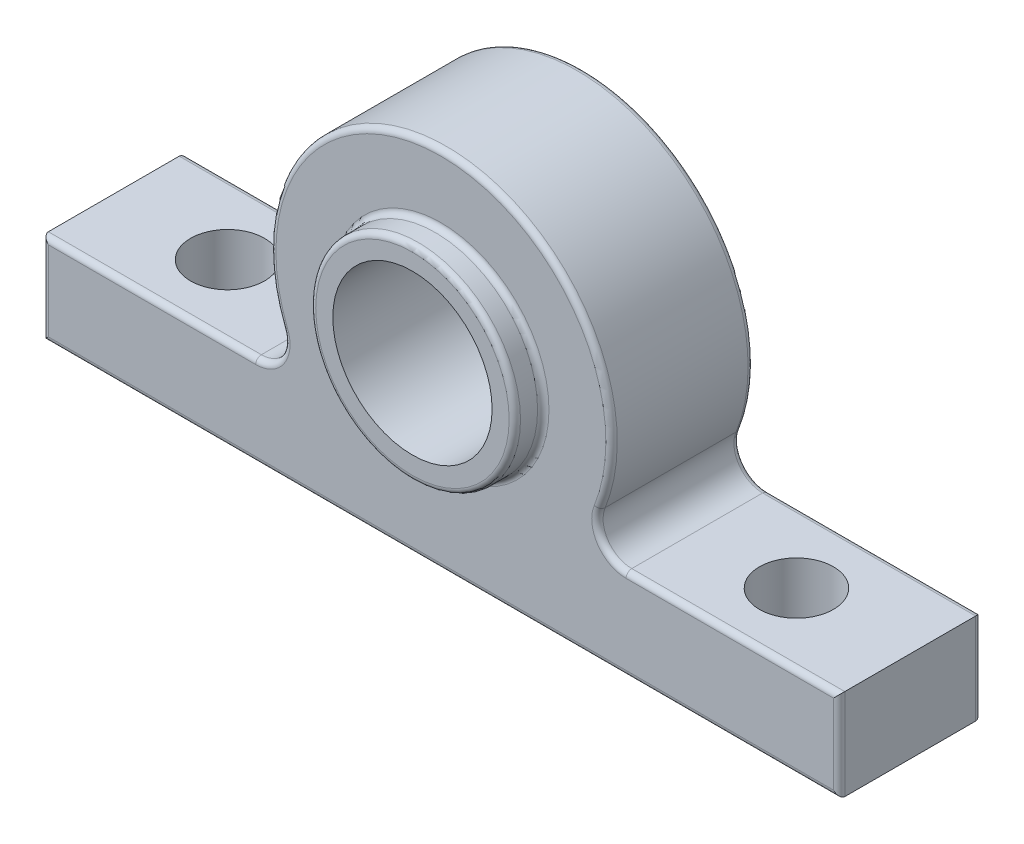
ISO-10303-21;
HEADER;
FILE_DESCRIPTION(('STEP AP214'),'2;1');
FILE_NAME('part.step','',(''),(''),'','','');
FILE_SCHEMA(('AUTOMOTIVE_DESIGN { 1 0 10303 214 1 1 1 1 }'));
ENDSEC;
DATA;
#1=APPLICATION_CONTEXT('core data for automotive mechanical design processes');
#2=APPLICATION_PROTOCOL_DEFINITION('international standard','automotive_design',2000,#1);
#3=PRODUCT_CONTEXT('',#1,'mechanical');
#4=PRODUCT('Part','Part','',(#3));
#5=PRODUCT_RELATED_PRODUCT_CATEGORY('part','',(#4));
#6=PRODUCT_DEFINITION_FORMATION('','',#4);
#7=PRODUCT_DEFINITION_CONTEXT('part definition',#1,'design');
#8=PRODUCT_DEFINITION('design','',#6,#7);
#9=PRODUCT_DEFINITION_SHAPE('','',#8);
#10=(LENGTH_UNIT() NAMED_UNIT(*) SI_UNIT(.MILLI.,.METRE.));
#11=(NAMED_UNIT(*) PLANE_ANGLE_UNIT() SI_UNIT($,.RADIAN.));
#12=(NAMED_UNIT(*) SI_UNIT($,.STERADIAN.) SOLID_ANGLE_UNIT());
#13=UNCERTAINTY_MEASURE_WITH_UNIT(LENGTH_MEASURE(1.E-05),#10,'distance_accuracy_value','');
#14=(GEOMETRIC_REPRESENTATION_CONTEXT(3) GLOBAL_UNCERTAINTY_ASSIGNED_CONTEXT((#13)) GLOBAL_UNIT_ASSIGNED_CONTEXT((#10,
#11,#12)) REPRESENTATION_CONTEXT('',''));
#15=CARTESIAN_POINT('',(0.,0.,0.));
#16=DIRECTION('',(0.,0.,1.));
#17=DIRECTION('',(1.,0.,0.));
#18=AXIS2_PLACEMENT_3D('',#15,#16,#17);
#19=CARTESIAN_POINT('',(0.,34.000000000006,25.));
#20=DIRECTION('',(0.,0.,-1.));
#21=DIRECTION('',(-1.,0.,0.));
#22=AXIS2_PLACEMENT_3D('',#19,#20,#21);
#23=CYLINDRICAL_SURFACE('',#22,14.00000000001);
#24=CARTESIAN_POINT('',(-1.2490009027033E-13,34.0000000000059,30.));
#25=DIRECTION('',(0.,0.,1.));
#26=DIRECTION('',(1.,0.,0.));
#27=AXIS2_PLACEMENT_3D('',#24,#25,#26);
#28=CIRCLE('',#27,14.0000000000099);
#29=CARTESIAN_POINT('',(14.0000000000097,34.0000000000059,30.));
#30=VERTEX_POINT('',#29);
#31=EDGE_CURVE('E477',#30,#30,#28,.T.);
#32=ORIENTED_EDGE('',*,*,#31,.T.);
#33=EDGE_LOOP('',(#32));
#34=FACE_BOUND('',#33,.T.);
#35=CARTESIAN_POINT('',(0.,34.000000000006,-5.));
#36=DIRECTION('',(0.,0.,-1.));
#37=DIRECTION('',(-1.,0.,0.));
#38=AXIS2_PLACEMENT_3D('',#35,#36,#37);
#39=CIRCLE('',#38,14.00000000001);
#40=CARTESIAN_POINT('',(-14.00000000001,34.000000000006,-5.));
#41=VERTEX_POINT('',#40);
#42=EDGE_CURVE('E479',#41,#41,#39,.T.);
#43=ORIENTED_EDGE('',*,*,#42,.T.);
#44=EDGE_LOOP('',(#43));
#45=FACE_BOUND('',#44,.T.);
#46=ADVANCED_FACE('F38',(#34,#45),#23,.F.);
#47=CARTESIAN_POINT('',(-32.5537951325998,21.0393178645808,25.));
#48=DIRECTION('',(0.,0.,-1.));
#49=DIRECTION('',(-1.,0.,0.));
#50=AXIS2_PLACEMENT_3D('',#47,#48,#49);
#51=CYLINDRICAL_SURFACE('',#50,5.03931786457549);
#52=DIRECTION('',(0.,0.,-1.));
#53=VECTOR('',#52,1.);
#54=CARTESIAN_POINT('',(-27.8926749949378,22.9546986628847,25.));
#55=LINE('',#54,#53);
#56=CARTESIAN_POINT('',(-27.8926749949378,22.9546986628847,24.));
#57=VERTEX_POINT('',#56);
#58=CARTESIAN_POINT('',(-27.8926749949378,22.9546986628847,1.));
#59=VERTEX_POINT('',#58);
#60=EDGE_CURVE('E478',#57,#59,#55,.T.);
#61=ORIENTED_EDGE('',*,*,#60,.T.);
#62=CARTESIAN_POINT('',(-32.5537951325998,21.0393178645808,1.));
#63=DIRECTION('',(0.,0.,1.));
#64=DIRECTION('',(1.,0.,0.));
#65=AXIS2_PLACEMENT_3D('',#62,#63,#64);
#66=CIRCLE('',#65,5.03931786457549);
#67=CARTESIAN_POINT('',(-32.5537951325998,16.0000000000053,1.));
#68=VERTEX_POINT('',#67);
#69=EDGE_CURVE('E47',#59,#68,#66,.F.);
#70=ORIENTED_EDGE('',*,*,#69,.T.);
#71=DIRECTION('',(0.,0.,-1.));
#72=VECTOR('',#71,1.);
#73=CARTESIAN_POINT('',(-32.5537951325998,16.0000000000053,25.));
#74=LINE('',#73,#72);
#75=CARTESIAN_POINT('',(-32.5537951325998,16.0000000000053,24.));
#76=VERTEX_POINT('',#75);
#77=EDGE_CURVE('E460',#76,#68,#74,.T.);
#78=ORIENTED_EDGE('',*,*,#77,.F.);
#79=CARTESIAN_POINT('',(-32.5537951325998,21.0393178645808,24.));
#80=DIRECTION('',(0.,0.,1.));
#81=DIRECTION('',(1.,0.,0.));
#82=AXIS2_PLACEMENT_3D('',#79,#80,#81);
#83=CIRCLE('',#82,5.03931786457549);
#84=EDGE_CURVE('E201',#76,#57,#83,.T.);
#85=ORIENTED_EDGE('',*,*,#84,.T.);
#86=EDGE_LOOP('',(#61,#70,#78,#85));
#87=FACE_BOUND('',#86,.T.);
#88=ADVANCED_FACE('F304',(#87),#51,.F.);
#89=CARTESIAN_POINT('',(0.,16.0000000000053,25.));
#90=DIRECTION('',(0.,1.,0.));
#91=DIRECTION('',(0.,0.,1.));
#92=AXIS2_PLACEMENT_3D('',#89,#90,#91);
#93=PLANE('',#92);
#94=CARTESIAN_POINT('',(-49.9999999999932,16.0000000000053,12.5));
#95=DIRECTION('',(0.,1.,0.));
#96=DIRECTION('',(0.,0.,1.));
#97=AXIS2_PLACEMENT_3D('',#94,#95,#96);
#98=CIRCLE('',#97,6.5);
#99=CARTESIAN_POINT('',(-49.9999999999932,16.0000000000053,19.));
#100=VERTEX_POINT('',#99);
#101=EDGE_CURVE('E408',#100,#100,#98,.T.);
#102=ORIENTED_EDGE('',*,*,#101,.F.);
#103=EDGE_LOOP('',(#102));
#104=FACE_BOUND('',#103,.T.);
#105=ORIENTED_EDGE('',*,*,#77,.T.);
#106=DIRECTION('',(1.,0.,0.));
#107=VECTOR('',#106,1.);
#108=CARTESIAN_POINT('',(-69.9999999999932,16.0000000000053,1.));
#109=LINE('',#108,#107);
#110=CARTESIAN_POINT('',(-69.9999999999932,16.0000000000053,1.));
#111=VERTEX_POINT('',#110);
#112=EDGE_CURVE('E428',#68,#111,#109,.F.);
#113=ORIENTED_EDGE('',*,*,#112,.T.);
#114=DIRECTION('',(0.,0.,-1.));
#115=VECTOR('',#114,1.);
#116=CARTESIAN_POINT('',(-69.9999999999932,16.0000000000053,25.));
#117=LINE('',#116,#115);
#118=CARTESIAN_POINT('',(-69.9999999999932,16.0000000000053,24.));
#119=VERTEX_POINT('',#118);
#120=EDGE_CURVE('E457',#119,#111,#117,.T.);
#121=ORIENTED_EDGE('',*,*,#120,.F.);
#122=DIRECTION('',(1.,0.,0.));
#123=VECTOR('',#122,1.);
#124=CARTESIAN_POINT('',(0.,16.0000000000053,24.));
#125=LINE('',#124,#123);
#126=EDGE_CURVE('E199',#119,#76,#125,.T.);
#127=ORIENTED_EDGE('',*,*,#126,.T.);
#128=EDGE_LOOP('',(#105,#113,#121,#127));
#129=FACE_BOUND('',#128,.T.);
#130=ADVANCED_FACE('F311',(#104,#129),#93,.T.);
#131=CARTESIAN_POINT('',(-69.9999999999932,-102.119017268005,25.));
#132=DIRECTION('',(1.,0.,0.));
#133=DIRECTION('',(0.,0.,-1.));
#134=AXIS2_PLACEMENT_3D('',#131,#132,#133);
#135=PLANE('',#134);
#136=ORIENTED_EDGE('',*,*,#120,.T.);
#137=DIRECTION('',(0.,-1.,0.));
#138=VECTOR('',#137,1.);
#139=CARTESIAN_POINT('',(-69.9999999999932,-102.119017268005,1.));
#140=LINE('',#139,#138);
#141=CARTESIAN_POINT('',(-69.9999999999932,0.,1.));
#142=VERTEX_POINT('',#141);
#143=EDGE_CURVE('E431',#111,#142,#140,.T.);
#144=ORIENTED_EDGE('',*,*,#143,.T.);
#145=DIRECTION('',(0.,0.,-1.));
#146=VECTOR('',#145,1.);
#147=CARTESIAN_POINT('',(-69.9999999999932,0.,25.));
#148=LINE('',#147,#146);
#149=CARTESIAN_POINT('',(-69.9999999999932,0.,24.));
#150=VERTEX_POINT('',#149);
#151=EDGE_CURVE('E462',#150,#142,#148,.T.);
#152=ORIENTED_EDGE('',*,*,#151,.F.);
#153=DIRECTION('',(0.,-1.,0.));
#154=VECTOR('',#153,1.);
#155=CARTESIAN_POINT('',(-69.9999999999932,16.0000000000053,24.));
#156=LINE('',#155,#154);
#157=EDGE_CURVE('E197',#150,#119,#156,.F.);
#158=ORIENTED_EDGE('',*,*,#157,.T.);
#159=EDGE_LOOP('',(#136,#144,#152,#158));
#160=FACE_BOUND('',#159,.T.);
#161=ADVANCED_FACE('F337',(#160),#135,.F.);
#162=CARTESIAN_POINT('',(0.,0.,25.));
#163=DIRECTION('',(0.,1.,0.));
#164=DIRECTION('',(0.,0.,1.));
#165=AXIS2_PLACEMENT_3D('',#162,#163,#164);
#166=PLANE('',#165);
#167=CARTESIAN_POINT('',(-49.9999999999932,5.34294830600857E-12,12.5));
#168=DIRECTION('',(0.,1.,0.));
#169=DIRECTION('',(0.,0.,1.));
#170=AXIS2_PLACEMENT_3D('',#167,#168,#169);
#171=CIRCLE('',#170,6.5);
#172=CARTESIAN_POINT('',(-49.9999999999932,5.34294830600857E-12,19.));
#173=VERTEX_POINT('',#172);
#174=EDGE_CURVE('E784',#173,#173,#171,.T.);
#175=ORIENTED_EDGE('',*,*,#174,.T.);
#176=EDGE_LOOP('',(#175));
#177=FACE_BOUND('',#176,.T.);
#178=CARTESIAN_POINT('',(49.9999999999932,5.34294830600857E-12,12.5));
#179=DIRECTION('',(0.,1.,0.));
#180=DIRECTION('',(0.,0.,1.));
#181=AXIS2_PLACEMENT_3D('',#178,#179,#180);
#182=CIRCLE('',#181,6.5);
#183=CARTESIAN_POINT('',(49.9999999999932,5.34294830600857E-12,19.));
#184=VERTEX_POINT('',#183);
#185=EDGE_CURVE('E484',#184,#184,#182,.T.);
#186=ORIENTED_EDGE('',*,*,#185,.T.);
#187=EDGE_LOOP('',(#186));
#188=FACE_BOUND('',#187,.T.);
#189=ORIENTED_EDGE('',*,*,#151,.T.);
#190=DIRECTION('',(1.,0.,0.));
#191=VECTOR('',#190,1.);
#192=CARTESIAN_POINT('',(0.,0.,1.));
#193=LINE('',#192,#191);
#194=CARTESIAN_POINT('',(69.9999999999932,0.,1.));
#195=VERTEX_POINT('',#194);
#196=EDGE_CURVE('E433',#142,#195,#193,.T.);
#197=ORIENTED_EDGE('',*,*,#196,.T.);
#198=DIRECTION('',(0.,0.,-1.));
#199=VECTOR('',#198,1.);
#200=CARTESIAN_POINT('',(69.9999999999932,0.,25.));
#201=LINE('',#200,#199);
#202=CARTESIAN_POINT('',(69.9999999999932,0.,24.));
#203=VERTEX_POINT('',#202);
#204=EDGE_CURVE('E465',#203,#195,#201,.T.);
#205=ORIENTED_EDGE('',*,*,#204,.F.);
#206=DIRECTION('',(1.,0.,0.));
#207=VECTOR('',#206,1.);
#208=CARTESIAN_POINT('',(-69.9999999999932,0.,24.));
#209=LINE('',#208,#207);
#210=EDGE_CURVE('E195',#203,#150,#209,.F.);
#211=ORIENTED_EDGE('',*,*,#210,.T.);
#212=EDGE_LOOP('',(#189,#197,#205,#211));
#213=FACE_BOUND('',#212,.T.);
#214=ADVANCED_FACE('F333',(#177,#188,#213),#166,.F.);
#215=CARTESIAN_POINT('',(69.9999999999932,-102.119017268005,25.));
#216=DIRECTION('',(-1.,0.,0.));
#217=DIRECTION('',(0.,0.,1.));
#218=AXIS2_PLACEMENT_3D('',#215,#216,#217);
#219=PLANE('',#218);
#220=ORIENTED_EDGE('',*,*,#204,.T.);
#221=DIRECTION('',(0.,1.,0.));
#222=VECTOR('',#221,1.);
#223=CARTESIAN_POINT('',(69.9999999999932,-102.119017268005,1.));
#224=LINE('',#223,#222);
#225=CARTESIAN_POINT('',(69.9999999999932,16.0000000000053,1.));
#226=VERTEX_POINT('',#225);
#227=EDGE_CURVE('E435',#195,#226,#224,.T.);
#228=ORIENTED_EDGE('',*,*,#227,.T.);
#229=DIRECTION('',(0.,0.,-1.));
#230=VECTOR('',#229,1.);
#231=CARTESIAN_POINT('',(69.9999999999932,16.0000000000053,25.));
#232=LINE('',#231,#230);
#233=CARTESIAN_POINT('',(69.9999999999932,16.0000000000053,24.));
#234=VERTEX_POINT('',#233);
#235=EDGE_CURVE('E491',#234,#226,#232,.T.);
#236=ORIENTED_EDGE('',*,*,#235,.F.);
#237=DIRECTION('',(0.,1.,0.));
#238=VECTOR('',#237,1.);
#239=CARTESIAN_POINT('',(69.9999999999932,0.,24.));
#240=LINE('',#239,#238);
#241=EDGE_CURVE('E193',#234,#203,#240,.F.);
#242=ORIENTED_EDGE('',*,*,#241,.T.);
#243=EDGE_LOOP('',(#220,#228,#236,#242));
#244=FACE_BOUND('',#243,.T.);
#245=ADVANCED_FACE('F329',(#244),#219,.F.);
#246=CARTESIAN_POINT('',(0.,16.0000000000053,25.));
#247=DIRECTION('',(0.,1.,0.));
#248=DIRECTION('',(0.,0.,1.));
#249=AXIS2_PLACEMENT_3D('',#246,#247,#248);
#250=PLANE('',#249);
#251=CARTESIAN_POINT('',(49.9999999999932,16.0000000000053,12.5));
#252=DIRECTION('',(0.,1.,0.));
#253=DIRECTION('',(0.,0.,1.));
#254=AXIS2_PLACEMENT_3D('',#251,#252,#253);
#255=CIRCLE('',#254,6.5);
#256=CARTESIAN_POINT('',(49.9999999999932,16.0000000000053,19.));
#257=VERTEX_POINT('',#256);
#258=EDGE_CURVE('E788',#257,#257,#255,.T.);
#259=ORIENTED_EDGE('',*,*,#258,.F.);
#260=EDGE_LOOP('',(#259));
#261=FACE_BOUND('',#260,.T.);
#262=ORIENTED_EDGE('',*,*,#235,.T.);
#263=DIRECTION('',(1.,0.,0.));
#264=VECTOR('',#263,1.);
#265=CARTESIAN_POINT('',(32.5537951326282,16.0000000000053,1.));
#266=LINE('',#265,#264);
#267=CARTESIAN_POINT('',(32.5537951326282,16.0000000000053,1.));
#268=VERTEX_POINT('',#267);
#269=EDGE_CURVE('E437',#226,#268,#266,.F.);
#270=ORIENTED_EDGE('',*,*,#269,.T.);
#271=DIRECTION('',(0.,0.,-1.));
#272=VECTOR('',#271,1.);
#273=CARTESIAN_POINT('',(32.5537951326282,16.0000000000053,25.));
#274=LINE('',#273,#272);
#275=CARTESIAN_POINT('',(32.5537951326282,16.0000000000053,24.));
#276=VERTEX_POINT('',#275);
#277=EDGE_CURVE('E489',#276,#268,#274,.T.);
#278=ORIENTED_EDGE('',*,*,#277,.F.);
#279=DIRECTION('',(1.,0.,0.));
#280=VECTOR('',#279,1.);
#281=CARTESIAN_POINT('',(0.,16.0000000000053,24.));
#282=LINE('',#281,#280);
#283=EDGE_CURVE('E191',#276,#234,#282,.T.);
#284=ORIENTED_EDGE('',*,*,#283,.T.);
#285=EDGE_LOOP('',(#262,#270,#278,#284));
#286=FACE_BOUND('',#285,.T.);
#287=ADVANCED_FACE('F326',(#261,#286),#250,.T.);
#288=CARTESIAN_POINT('',(32.5537951326282,21.0393178645731,25.));
#289=DIRECTION('',(0.,0.,-1.));
#290=DIRECTION('',(-1.,0.,0.));
#291=AXIS2_PLACEMENT_3D('',#288,#289,#290);
#292=CYLINDRICAL_SURFACE('',#291,5.03931786456775);
#293=ORIENTED_EDGE('',*,*,#277,.T.);
#294=CARTESIAN_POINT('',(32.5537951326282,21.0393178645731,1.));
#295=DIRECTION('',(0.,0.,1.));
#296=DIRECTION('',(1.,0.,0.));
#297=AXIS2_PLACEMENT_3D('',#294,#295,#296);
#298=CIRCLE('',#297,5.03931786456775);
#299=CARTESIAN_POINT('',(27.8926749938777,22.9546986602078,1.));
#300=VERTEX_POINT('',#299);
#301=EDGE_CURVE('E63',#268,#300,#298,.F.);
#302=ORIENTED_EDGE('',*,*,#301,.T.);
#303=DIRECTION('',(0.,0.,-1.));
#304=VECTOR('',#303,1.);
#305=CARTESIAN_POINT('',(27.8926749938777,22.9546986602078,25.));
#306=LINE('',#305,#304);
#307=CARTESIAN_POINT('',(27.8926749938777,22.9546986602078,24.));
#308=VERTEX_POINT('',#307);
#309=EDGE_CURVE('E481',#308,#300,#306,.T.);
#310=ORIENTED_EDGE('',*,*,#309,.F.);
#311=CARTESIAN_POINT('',(32.5537951326282,21.0393178645731,24.));
#312=DIRECTION('',(0.,0.,1.));
#313=DIRECTION('',(1.,0.,0.));
#314=AXIS2_PLACEMENT_3D('',#311,#312,#313);
#315=CIRCLE('',#314,5.03931786456775);
#316=EDGE_CURVE('E184',#308,#276,#315,.T.);
#317=ORIENTED_EDGE('',*,*,#316,.T.);
#318=EDGE_LOOP('',(#293,#302,#310,#317));
#319=FACE_BOUND('',#318,.T.);
#320=ADVANCED_FACE('F323',(#319),#292,.F.);
#321=CARTESIAN_POINT('',(0.,34.000000000006,25.));
#322=DIRECTION('',(0.,0.,-1.));
#323=DIRECTION('',(-1.,0.,0.));
#324=AXIS2_PLACEMENT_3D('',#321,#322,#323);
#325=CYLINDRICAL_SURFACE('',#324,30.0000000000173);
#326=ORIENTED_EDGE('',*,*,#309,.T.);
#327=CARTESIAN_POINT('',(0.,34.000000000006,1.));
#328=DIRECTION('',(0.,0.,1.));
#329=DIRECTION('',(1.,0.,0.));
#330=AXIS2_PLACEMENT_3D('',#327,#328,#329);
#331=CIRCLE('',#330,30.0000000000173);
#332=EDGE_CURVE('E55',#300,#59,#331,.T.);
#333=ORIENTED_EDGE('',*,*,#332,.T.);
#334=ORIENTED_EDGE('',*,*,#60,.F.);
#335=CARTESIAN_POINT('',(0.,34.000000000006,24.));
#336=DIRECTION('',(0.,0.,1.));
#337=DIRECTION('',(1.,0.,0.));
#338=AXIS2_PLACEMENT_3D('',#335,#336,#337);
#339=CIRCLE('',#338,30.0000000000173);
#340=EDGE_CURVE('E163',#57,#308,#339,.F.);
#341=ORIENTED_EDGE('',*,*,#340,.T.);
#342=EDGE_LOOP('',(#326,#333,#334,#341));
#343=FACE_BOUND('',#342,.T.);
#344=ADVANCED_FACE('F320',(#343),#325,.T.);
#345=CARTESIAN_POINT('',(0.,-102.119017268005,25.));
#346=DIRECTION('',(0.,0.,1.));
#347=DIRECTION('',(1.,0.,0.));
#348=AXIS2_PLACEMENT_3D('',#345,#346,#347);
#349=PLANE('',#348);
#350=CARTESIAN_POINT('',(32.5537951326282,21.0393178645731,25.));
#351=DIRECTION('',(0.,0.,1.));
#352=DIRECTION('',(1.,0.,0.));
#353=AXIS2_PLACEMENT_3D('',#350,#351,#352);
#354=CIRCLE('',#353,6.03931786456775);
#355=CARTESIAN_POINT('',(32.5537951326282,15.0000000000053,25.));
#356=VERTEX_POINT('',#355);
#357=CARTESIAN_POINT('',(26.9651560159953,23.3285258265824,25.));
#358=VERTEX_POINT('',#357);
#359=EDGE_CURVE('E181',#356,#358,#354,.F.);
#360=ORIENTED_EDGE('',*,*,#359,.T.);
#361=CARTESIAN_POINT('',(0.,34.000000000006,25.));
#362=DIRECTION('',(0.,0.,1.));
#363=DIRECTION('',(1.,0.,0.));
#364=AXIS2_PLACEMENT_3D('',#361,#362,#363);
#365=CIRCLE('',#364,29.0000000000173);
#366=CARTESIAN_POINT('',(-26.9651560171355,23.3285258294637,25.));
#367=VERTEX_POINT('',#366);
#368=EDGE_CURVE('E161',#358,#367,#365,.T.);
#369=ORIENTED_EDGE('',*,*,#368,.T.);
#370=CARTESIAN_POINT('',(-32.5537951325998,21.0393178645808,25.));
#371=DIRECTION('',(0.,0.,1.));
#372=DIRECTION('',(1.,0.,0.));
#373=AXIS2_PLACEMENT_3D('',#370,#371,#372);
#374=CIRCLE('',#373,6.03931786457549);
#375=CARTESIAN_POINT('',(-32.5537951325998,15.0000000000053,25.));
#376=VERTEX_POINT('',#375);
#377=EDGE_CURVE('E169',#367,#376,#374,.F.);
#378=ORIENTED_EDGE('',*,*,#377,.T.);
#379=DIRECTION('',(1.,0.,0.));
#380=VECTOR('',#379,1.);
#381=CARTESIAN_POINT('',(0.,15.0000000000053,25.));
#382=LINE('',#381,#380);
#383=CARTESIAN_POINT('',(-68.9999999999932,15.0000000000053,25.));
#384=VERTEX_POINT('',#383);
#385=EDGE_CURVE('E175',#376,#384,#382,.F.);
#386=ORIENTED_EDGE('',*,*,#385,.T.);
#387=DIRECTION('',(0.,-1.,0.));
#388=VECTOR('',#387,1.);
#389=CARTESIAN_POINT('',(-68.9999999999932,0.,25.));
#390=LINE('',#389,#388);
#391=CARTESIAN_POINT('',(-68.9999999999932,1.,25.));
#392=VERTEX_POINT('',#391);
#393=EDGE_CURVE('E381',#384,#392,#390,.T.);
#394=ORIENTED_EDGE('',*,*,#393,.T.);
#395=DIRECTION('',(1.,0.,0.));
#396=VECTOR('',#395,1.);
#397=CARTESIAN_POINT('',(69.9999999999932,1.,25.));
#398=LINE('',#397,#396);
#399=CARTESIAN_POINT('',(68.9999999999932,1.,25.));
#400=VERTEX_POINT('',#399);
#401=EDGE_CURVE('E383',#392,#400,#398,.T.);
#402=ORIENTED_EDGE('',*,*,#401,.T.);
#403=DIRECTION('',(0.,1.,0.));
#404=VECTOR('',#403,1.);
#405=CARTESIAN_POINT('',(68.9999999999932,16.0000000000053,25.));
#406=LINE('',#405,#404);
#407=CARTESIAN_POINT('',(68.9999999999932,15.0000000000053,25.));
#408=VERTEX_POINT('',#407);
#409=EDGE_CURVE('E385',#400,#408,#406,.T.);
#410=ORIENTED_EDGE('',*,*,#409,.T.);
#411=DIRECTION('',(1.,0.,0.));
#412=VECTOR('',#411,1.);
#413=CARTESIAN_POINT('',(0.,15.0000000000053,25.));
#414=LINE('',#413,#412);
#415=EDGE_CURVE('E186',#408,#356,#414,.F.);
#416=ORIENTED_EDGE('',*,*,#415,.T.);
#417=EDGE_LOOP('',(#360,#369,#378,#386,#394,#402,#410,#416));
#418=FACE_BOUND('',#417,.T.);
#419=CARTESIAN_POINT('',(0.,33.8926647847178,25.));
#420=DIRECTION('',(0.,0.,1.));
#421=DIRECTION('',(1.,0.,0.));
#422=AXIS2_PLACEMENT_3D('',#419,#420,#421);
#423=CIRCLE('',#422,19.);
#424=CARTESIAN_POINT('',(19.,33.8926647847178,25.));
#425=VERTEX_POINT('',#424);
#426=EDGE_CURVE('E176',#425,#425,#423,.F.);
#427=ORIENTED_EDGE('',*,*,#426,.T.);
#428=EDGE_LOOP('',(#427));
#429=FACE_BOUND('',#428,.T.);
#430=ADVANCED_FACE('F178',(#418,#429),#349,.T.);
#431=CARTESIAN_POINT('',(0.,-102.119017268005,0.));
#432=DIRECTION('',(0.,0.,1.));
#433=DIRECTION('',(1.,0.,0.));
#434=AXIS2_PLACEMENT_3D('',#431,#432,#433);
#435=PLANE('',#434);
#436=DIRECTION('',(0.,-1.,0.));
#437=VECTOR('',#436,1.);
#438=CARTESIAN_POINT('',(-68.9999999999932,-102.119017268005,0.));
#439=LINE('',#438,#437);
#440=CARTESIAN_POINT('',(-68.9999999999932,1.,0.));
#441=VERTEX_POINT('',#440);
#442=CARTESIAN_POINT('',(-68.9999999999932,15.0000000000053,0.));
#443=VERTEX_POINT('',#442);
#444=EDGE_CURVE('E423',#441,#443,#439,.F.);
#445=ORIENTED_EDGE('',*,*,#444,.T.);
#446=DIRECTION('',(1.,0.,0.));
#447=VECTOR('',#446,1.);
#448=CARTESIAN_POINT('',(-32.5537951325998,15.0000000000053,0.));
#449=LINE('',#448,#447);
#450=CARTESIAN_POINT('',(-32.5537951325998,15.0000000000053,0.));
#451=VERTEX_POINT('',#450);
#452=EDGE_CURVE('E425',#443,#451,#449,.T.);
#453=ORIENTED_EDGE('',*,*,#452,.T.);
#454=CARTESIAN_POINT('',(-32.5537951325998,21.0393178645808,0.));
#455=DIRECTION('',(0.,0.,1.));
#456=DIRECTION('',(1.,0.,0.));
#457=AXIS2_PLACEMENT_3D('',#454,#455,#456);
#458=CIRCLE('',#457,6.03931786457549);
#459=CARTESIAN_POINT('',(-26.9651560171355,23.3285258294637,0.));
#460=VERTEX_POINT('',#459);
#461=EDGE_CURVE('E411',#451,#460,#458,.T.);
#462=ORIENTED_EDGE('',*,*,#461,.T.);
#463=CARTESIAN_POINT('',(0.,34.000000000006,0.));
#464=DIRECTION('',(0.,0.,1.));
#465=DIRECTION('',(1.,0.,0.));
#466=AXIS2_PLACEMENT_3D('',#463,#464,#465);
#467=CIRCLE('',#466,29.0000000000173);
#468=CARTESIAN_POINT('',(26.9651560159952,23.3285258265825,0.));
#469=VERTEX_POINT('',#468);
#470=EDGE_CURVE('E413',#460,#469,#467,.F.);
#471=ORIENTED_EDGE('',*,*,#470,.T.);
#472=CARTESIAN_POINT('',(32.5537951326282,21.0393178645731,0.));
#473=DIRECTION('',(0.,0.,1.));
#474=DIRECTION('',(1.,0.,0.));
#475=AXIS2_PLACEMENT_3D('',#472,#473,#474);
#476=CIRCLE('',#475,6.03931786456775);
#477=CARTESIAN_POINT('',(32.5537951326282,15.0000000000053,0.));
#478=VERTEX_POINT('',#477);
#479=EDGE_CURVE('E415',#469,#478,#476,.T.);
#480=ORIENTED_EDGE('',*,*,#479,.T.);
#481=DIRECTION('',(1.,0.,0.));
#482=VECTOR('',#481,1.);
#483=CARTESIAN_POINT('',(69.9999999999932,15.0000000000053,0.));
#484=LINE('',#483,#482);
#485=CARTESIAN_POINT('',(68.9999999999932,15.0000000000053,0.));
#486=VERTEX_POINT('',#485);
#487=EDGE_CURVE('E417',#478,#486,#484,.T.);
#488=ORIENTED_EDGE('',*,*,#487,.T.);
#489=DIRECTION('',(0.,1.,0.));
#490=VECTOR('',#489,1.);
#491=CARTESIAN_POINT('',(68.9999999999932,-102.119017268005,0.));
#492=LINE('',#491,#490);
#493=CARTESIAN_POINT('',(68.9999999999932,1.,0.));
#494=VERTEX_POINT('',#493);
#495=EDGE_CURVE('E419',#486,#494,#492,.F.);
#496=ORIENTED_EDGE('',*,*,#495,.T.);
#497=DIRECTION('',(1.,0.,0.));
#498=VECTOR('',#497,1.);
#499=CARTESIAN_POINT('',(0.,1.,0.));
#500=LINE('',#499,#498);
#501=EDGE_CURVE('E421',#494,#441,#500,.F.);
#502=ORIENTED_EDGE('',*,*,#501,.T.);
#503=EDGE_LOOP('',(#445,#453,#462,#471,#480,#488,#496,#502));
#504=FACE_BOUND('',#503,.T.);
#505=CARTESIAN_POINT('',(0.,34.000000000006,0.));
#506=DIRECTION('',(0.,0.,1.));
#507=DIRECTION('',(1.,0.,0.));
#508=AXIS2_PLACEMENT_3D('',#505,#506,#507);
#509=CIRCLE('',#508,19.0000000000001);
#510=CARTESIAN_POINT('',(19.0000000000001,34.000000000006,0.));
#511=VERTEX_POINT('',#510);
#512=EDGE_CURVE('E205',#511,#511,#509,.T.);
#513=ORIENTED_EDGE('',*,*,#512,.T.);
#514=EDGE_LOOP('',(#513));
#515=FACE_BOUND('',#514,.T.);
#516=ADVANCED_FACE('F318',(#504,#515),#435,.F.);
#517=CARTESIAN_POINT('',(0.,33.8926647847178,30.));
#518=DIRECTION('',(0.,0.,1.));
#519=DIRECTION('',(1.,0.,0.));
#520=AXIS2_PLACEMENT_3D('',#517,#518,#519);
#521=PLANE('',#520);
#522=CARTESIAN_POINT('',(0.,33.8926647847178,30.));
#523=DIRECTION('',(0.,0.,1.));
#524=DIRECTION('',(1.,0.,0.));
#525=AXIS2_PLACEMENT_3D('',#522,#523,#524);
#526=CIRCLE('',#525,17.);
#527=CARTESIAN_POINT('',(17.,33.8926647847178,30.));
#528=VERTEX_POINT('',#527);
#529=EDGE_CURVE('E374',#528,#528,#526,.T.);
#530=ORIENTED_EDGE('',*,*,#529,.T.);
#531=EDGE_LOOP('',(#530));
#532=FACE_BOUND('',#531,.T.);
#533=ORIENTED_EDGE('',*,*,#31,.F.);
#534=EDGE_LOOP('',(#533));
#535=FACE_BOUND('',#534,.T.);
#536=ADVANCED_FACE('F471',(#532,#535),#521,.T.);
#537=CARTESIAN_POINT('',(0.,33.8926647847178,30.));
#538=DIRECTION('',(0.,0.,-1.));
#539=DIRECTION('',(-1.,0.,0.));
#540=AXIS2_PLACEMENT_3D('',#537,#538,#539);
#541=CYLINDRICAL_SURFACE('',#540,18.);
#542=CARTESIAN_POINT('',(0.,33.8926647847178,26.));
#543=DIRECTION('',(0.,0.,1.));
#544=DIRECTION('',(1.,0.,0.));
#545=AXIS2_PLACEMENT_3D('',#542,#543,#544);
#546=CIRCLE('',#545,18.);
#547=CARTESIAN_POINT('',(18.,33.8926647847178,26.));
#548=VERTEX_POINT('',#547);
#549=EDGE_CURVE('E203',#548,#548,#546,.T.);
#550=ORIENTED_EDGE('',*,*,#549,.T.);
#551=EDGE_LOOP('',(#550));
#552=FACE_BOUND('',#551,.T.);
#553=CARTESIAN_POINT('',(0.,33.8926647847178,29.));
#554=DIRECTION('',(0.,0.,1.));
#555=DIRECTION('',(1.,0.,0.));
#556=AXIS2_PLACEMENT_3D('',#553,#554,#555);
#557=CIRCLE('',#556,18.);
#558=CARTESIAN_POINT('',(18.,33.8926647847178,29.));
#559=VERTEX_POINT('',#558);
#560=EDGE_CURVE('E370',#559,#559,#557,.F.);
#561=ORIENTED_EDGE('',*,*,#560,.T.);
#562=EDGE_LOOP('',(#561));
#563=FACE_BOUND('',#562,.T.);
#564=ADVANCED_FACE('F348',(#552,#563),#541,.T.);
#565=CARTESIAN_POINT('',(0.,33.8926647847178,29.));
#566=DIRECTION('',(0.,0.,1.));
#567=DIRECTION('',(1.,0.,0.));
#568=AXIS2_PLACEMENT_3D('',#565,#566,#567);
#569=TOROIDAL_SURFACE('',#568,17.,1.);
#570=ORIENTED_EDGE('',*,*,#560,.F.);
#571=EDGE_LOOP('',(#570));
#572=FACE_BOUND('',#571,.T.);
#573=ORIENTED_EDGE('',*,*,#529,.F.);
#574=EDGE_LOOP('',(#573));
#575=FACE_BOUND('',#574,.T.);
#576=ADVANCED_FACE('F345',(#572,#575),#569,.T.);
#577=CARTESIAN_POINT('',(0.,34.000000000006,-5.));
#578=DIRECTION('',(0.,0.,1.));
#579=DIRECTION('',(1.,0.,0.));
#580=AXIS2_PLACEMENT_3D('',#577,#578,#579);
#581=CYLINDRICAL_SURFACE('',#580,18.0000000000001);
#582=CARTESIAN_POINT('',(0.,34.000000000006,-1.));
#583=DIRECTION('',(0.,0.,1.));
#584=DIRECTION('',(1.,0.,0.));
#585=AXIS2_PLACEMENT_3D('',#582,#583,#584);
#586=CIRCLE('',#585,18.0000000000001);
#587=CARTESIAN_POINT('',(18.0000000000001,34.000000000006,-1.));
#588=VERTEX_POINT('',#587);
#589=EDGE_CURVE('E11',#588,#588,#586,.F.);
#590=ORIENTED_EDGE('',*,*,#589,.T.);
#591=EDGE_LOOP('',(#590));
#592=FACE_BOUND('',#591,.T.);
#593=CARTESIAN_POINT('',(0.,34.000000000006,-4.));
#594=DIRECTION('',(0.,0.,-1.));
#595=DIRECTION('',(-1.,0.,0.));
#596=AXIS2_PLACEMENT_3D('',#593,#594,#595);
#597=CIRCLE('',#596,18.0000000000001);
#598=CARTESIAN_POINT('',(-18.0000000000001,34.000000000006,-4.));
#599=VERTEX_POINT('',#598);
#600=EDGE_CURVE('E366',#599,#599,#597,.F.);
#601=ORIENTED_EDGE('',*,*,#600,.T.);
#602=EDGE_LOOP('',(#601));
#603=FACE_BOUND('',#602,.T.);
#604=ADVANCED_FACE('F347',(#592,#603),#581,.T.);
#605=CARTESIAN_POINT('',(0.,34.000000000006,-5.));
#606=DIRECTION('',(0.,0.,-1.));
#607=DIRECTION('',(-1.,0.,0.));
#608=AXIS2_PLACEMENT_3D('',#605,#606,#607);
#609=PLANE('',#608);
#610=CARTESIAN_POINT('',(0.,34.000000000006,-5.));
#611=DIRECTION('',(0.,0.,-1.));
#612=DIRECTION('',(-1.,0.,0.));
#613=AXIS2_PLACEMENT_3D('',#610,#611,#612);
#614=CIRCLE('',#613,17.0000000000001);
#615=CARTESIAN_POINT('',(-17.0000000000001,34.000000000006,-5.));
#616=VERTEX_POINT('',#615);
#617=EDGE_CURVE('E369',#616,#616,#614,.T.);
#618=ORIENTED_EDGE('',*,*,#617,.T.);
#619=EDGE_LOOP('',(#618));
#620=FACE_BOUND('',#619,.T.);
#621=ORIENTED_EDGE('',*,*,#42,.F.);
#622=EDGE_LOOP('',(#621));
#623=FACE_BOUND('',#622,.T.);
#624=ADVANCED_FACE('F353',(#620,#623),#609,.T.);
#625=CARTESIAN_POINT('',(0.,34.000000000006,-4.));
#626=DIRECTION('',(0.,0.,-1.));
#627=DIRECTION('',(-1.,0.,0.));
#628=AXIS2_PLACEMENT_3D('',#625,#626,#627);
#629=TOROIDAL_SURFACE('',#628,17.0000000000001,1.);
#630=ORIENTED_EDGE('',*,*,#600,.F.);
#631=EDGE_LOOP('',(#630));
#632=FACE_BOUND('',#631,.T.);
#633=ORIENTED_EDGE('',*,*,#617,.F.);
#634=EDGE_LOOP('',(#633));
#635=FACE_BOUND('',#634,.T.);
#636=ADVANCED_FACE('F350',(#632,#635),#629,.T.);
#637=CARTESIAN_POINT('',(49.9999999999932,5.34294830600857E-12,12.5));
#638=DIRECTION('',(0.,1.,0.));
#639=DIRECTION('',(0.,0.,1.));
#640=AXIS2_PLACEMENT_3D('',#637,#638,#639);
#641=CYLINDRICAL_SURFACE('',#640,6.5);
#642=ORIENTED_EDGE('',*,*,#185,.F.);
#643=EDGE_LOOP('',(#642));
#644=FACE_BOUND('',#643,.T.);
#645=ORIENTED_EDGE('',*,*,#258,.T.);
#646=EDGE_LOOP('',(#645));
#647=FACE_BOUND('',#646,.T.);
#648=ADVANCED_FACE('F352',(#644,#647),#641,.F.);
#649=CARTESIAN_POINT('',(-49.9999999999932,5.34294830600857E-12,12.5));
#650=DIRECTION('',(0.,1.,0.));
#651=DIRECTION('',(0.,0.,1.));
#652=AXIS2_PLACEMENT_3D('',#649,#650,#651);
#653=CYLINDRICAL_SURFACE('',#652,6.5);
#654=ORIENTED_EDGE('',*,*,#174,.F.);
#655=EDGE_LOOP('',(#654));
#656=FACE_BOUND('',#655,.T.);
#657=ORIENTED_EDGE('',*,*,#101,.T.);
#658=EDGE_LOOP('',(#657));
#659=FACE_BOUND('',#658,.T.);
#660=ADVANCED_FACE('F245',(#656,#659),#653,.F.);
#661=CARTESIAN_POINT('',(0.,1.,24.));
#662=DIRECTION('',(-1.,0.,0.));
#663=DIRECTION('',(0.,0.,1.));
#664=AXIS2_PLACEMENT_3D('',#661,#662,#663);
#665=CYLINDRICAL_SURFACE('',#664,1.);
#666=CARTESIAN_POINT('',(-68.9999999999932,1.,24.));
#667=DIRECTION('',(-0.707106781186547,0.707106781186547,0.));
#668=DIRECTION('',(0.707106781186547,0.707106781186547,0.));
#669=AXIS2_PLACEMENT_3D('',#666,#667,#668);
#670=ELLIPSE('',#669,1.41421356237309,1.);
#671=EDGE_CURVE('E402',#150,#392,#670,.T.);
#672=ORIENTED_EDGE('',*,*,#671,.F.);
#673=ORIENTED_EDGE('',*,*,#210,.F.);
#674=CARTESIAN_POINT('',(68.9999999999932,1.,24.));
#675=DIRECTION('',(-0.707106781186547,-0.707106781186547,0.));
#676=DIRECTION('',(-0.707106781186547,0.707106781186547,0.));
#677=AXIS2_PLACEMENT_3D('',#674,#675,#676);
#678=ELLIPSE('',#677,1.41421356237309,1.);
#679=EDGE_CURVE('E405',#400,#203,#678,.F.);
#680=ORIENTED_EDGE('',*,*,#679,.F.);
#681=ORIENTED_EDGE('',*,*,#401,.F.);
#682=EDGE_LOOP('',(#672,#673,#680,#681));
#683=FACE_BOUND('',#682,.T.);
#684=ADVANCED_FACE('F241',(#683),#665,.T.);
#685=CARTESIAN_POINT('',(68.9999999999932,-102.119017268005,24.));
#686=DIRECTION('',(0.,-1.,0.));
#687=DIRECTION('',(0.,0.,-1.));
#688=AXIS2_PLACEMENT_3D('',#685,#686,#687);
#689=CYLINDRICAL_SURFACE('',#688,1.);
#690=ORIENTED_EDGE('',*,*,#679,.T.);
#691=ORIENTED_EDGE('',*,*,#241,.F.);
#692=CARTESIAN_POINT('',(68.9999999999932,15.0000000000053,24.));
#693=DIRECTION('',(0.707106781186547,-0.707106781186547,0.));
#694=DIRECTION('',(-0.707106781186547,-0.707106781186547,0.));
#695=AXIS2_PLACEMENT_3D('',#692,#693,#694);
#696=ELLIPSE('',#695,1.41421356237309,1.);
#697=EDGE_CURVE('E400',#408,#234,#696,.F.);
#698=ORIENTED_EDGE('',*,*,#697,.F.);
#699=ORIENTED_EDGE('',*,*,#409,.F.);
#700=EDGE_LOOP('',(#690,#691,#698,#699));
#701=FACE_BOUND('',#700,.T.);
#702=ADVANCED_FACE('F237',(#701),#689,.T.);
#703=CARTESIAN_POINT('',(-68.9999999999932,-102.119017268005,24.));
#704=DIRECTION('',(0.,1.,0.));
#705=DIRECTION('',(0.,0.,1.));
#706=AXIS2_PLACEMENT_3D('',#703,#704,#705);
#707=CYLINDRICAL_SURFACE('',#706,1.);
#708=ORIENTED_EDGE('',*,*,#671,.T.);
#709=ORIENTED_EDGE('',*,*,#393,.F.);
#710=CARTESIAN_POINT('',(-68.9999999999932,15.0000000000053,24.));
#711=DIRECTION('',(0.707106781186547,0.707106781186547,0.));
#712=DIRECTION('',(0.707106781186547,-0.707106781186547,0.));
#713=AXIS2_PLACEMENT_3D('',#710,#711,#712);
#714=ELLIPSE('',#713,1.41421356237309,1.);
#715=EDGE_CURVE('E395',#119,#384,#714,.T.);
#716=ORIENTED_EDGE('',*,*,#715,.F.);
#717=ORIENTED_EDGE('',*,*,#157,.F.);
#718=EDGE_LOOP('',(#708,#709,#716,#717));
#719=FACE_BOUND('',#718,.T.);
#720=ADVANCED_FACE('F233',(#719),#707,.T.);
#721=CARTESIAN_POINT('',(0.,15.0000000000053,24.));
#722=DIRECTION('',(1.,0.,0.));
#723=DIRECTION('',(0.,0.,-1.));
#724=AXIS2_PLACEMENT_3D('',#721,#722,#723);
#725=CYLINDRICAL_SURFACE('',#724,1.);
#726=ORIENTED_EDGE('',*,*,#697,.T.);
#727=ORIENTED_EDGE('',*,*,#283,.F.);
#728=CARTESIAN_POINT('',(32.5537951326282,15.0000000000053,24.));
#729=DIRECTION('',(-1.,0.,0.));
#730=DIRECTION('',(0.,0.,1.));
#731=AXIS2_PLACEMENT_3D('',#728,#729,#730);
#732=CIRCLE('',#731,1.);
#733=EDGE_CURVE('E393',#356,#276,#732,.T.);
#734=ORIENTED_EDGE('',*,*,#733,.F.);
#735=ORIENTED_EDGE('',*,*,#415,.F.);
#736=EDGE_LOOP('',(#726,#727,#734,#735));
#737=FACE_BOUND('',#736,.T.);
#738=ADVANCED_FACE('F229',(#737),#725,.T.);
#739=CARTESIAN_POINT('',(0.,15.0000000000053,24.));
#740=DIRECTION('',(1.,0.,0.));
#741=DIRECTION('',(0.,0.,-1.));
#742=AXIS2_PLACEMENT_3D('',#739,#740,#741);
#743=CYLINDRICAL_SURFACE('',#742,1.);
#744=ORIENTED_EDGE('',*,*,#715,.T.);
#745=ORIENTED_EDGE('',*,*,#385,.F.);
#746=CARTESIAN_POINT('',(-32.5537951325998,15.0000000000053,24.));
#747=DIRECTION('',(1.,0.,0.));
#748=DIRECTION('',(0.,0.,-1.));
#749=AXIS2_PLACEMENT_3D('',#746,#747,#748);
#750=CIRCLE('',#749,1.);
#751=EDGE_CURVE('E172',#76,#376,#750,.T.);
#752=ORIENTED_EDGE('',*,*,#751,.F.);
#753=ORIENTED_EDGE('',*,*,#126,.F.);
#754=EDGE_LOOP('',(#744,#745,#752,#753));
#755=FACE_BOUND('',#754,.T.);
#756=ADVANCED_FACE('F225',(#755),#743,.T.);
#757=CARTESIAN_POINT('',(32.5537951326282,21.0393178645731,24.));
#758=DIRECTION('',(0.,0.,1.));
#759=DIRECTION('',(1.,0.,0.));
#760=AXIS2_PLACEMENT_3D('',#757,#758,#759);
#761=TOROIDAL_SURFACE('',#760,6.03931786456775,1.);
#762=ORIENTED_EDGE('',*,*,#733,.T.);
#763=ORIENTED_EDGE('',*,*,#316,.F.);
#764=CARTESIAN_POINT('',(27.8926749938777,22.9546986602078,24.));
#765=CARTESIAN_POINT('',(27.8926748177765,22.9546987257266,24.0281332126344));
#766=CARTESIAN_POINT('',(27.89157328855,22.9551431335401,24.0562529461695));
#767=CARTESIAN_POINT('',(27.8871788276243,22.9569160265104,24.1122912096047));
#768=CARTESIAN_POINT('',(27.8838860008017,22.9582444693569,24.1402097490694));
#769=CARTESIAN_POINT('',(27.870751131487,22.9635434522012,24.2233192022581));
#770=CARTESIAN_POINT('',(27.8576526181983,22.9688276798424,24.2779533700362));
#771=CARTESIAN_POINT('',(27.8231350549641,22.9827517931262,24.3840734649948));
#772=CARTESIAN_POINT('',(27.8017119815474,22.9913933014276,24.4355578558595));
#773=CARTESIAN_POINT('',(27.751157426023,23.0117836632965,24.5339117234291));
#774=CARTESIAN_POINT('',(27.7220279747982,23.0235316981921,24.5807824115371));
#775=CARTESIAN_POINT('',(27.6568883639267,23.0497996369621,24.6685805535761));
#776=CARTESIAN_POINT('',(27.620878782314,23.0643193079773,24.7095085062779));
#777=CARTESIAN_POINT('',(27.5429780653111,23.0957259273327,24.7842845565953));
#778=CARTESIAN_POINT('',(27.5010842866473,23.1126139395637,24.8181294552838));
#779=CARTESIAN_POINT('',(27.4126049165715,23.1482760865968,24.8777675900194));
#780=CARTESIAN_POINT('',(27.366017042212,23.1670511391394,24.9035568830245));
#781=CARTESIAN_POINT('',(27.269520710707,23.205933531592,24.9463035878178));
#782=CARTESIAN_POINT('',(27.2196169552445,23.226038984928,24.9632732160904));
#783=CARTESIAN_POINT('',(27.1441338231855,23.25644535998,24.9815900213362));
#784=CARTESIAN_POINT('',(27.1192521905161,23.2664675460684,24.9864827378052));
#785=CARTESIAN_POINT('',(27.069220416064,23.2866186173639,24.9940593803298));
#786=CARTESIAN_POINT('',(27.0440705932959,23.2967473756449,24.9967456861902));
#787=CARTESIAN_POINT('',(27.0009790983175,23.3141006706814,24.9994413071194));
#788=CARTESIAN_POINT('',(26.9830658693025,23.3213141108773,25.0000015916638));
#789=CARTESIAN_POINT('',(26.9651560159921,23.3285258265748,25.));
#790=B_SPLINE_CURVE_WITH_KNOTS('',3,(#764,#765,#766,#767,#768,#769,#770,#771,#772,#773,#774,
#775,#776,#777,#778,#779,#780,#781,#782,#783,#784,#785,#786,#787,#788,#789),.UNSPECIFIED.,.F.,
.F.,(4,2,2,2,2,2,2,2,2,2,2,2,4),(0.,0.0843477969143148,0.168691557194018,0.337114234327377,
0.505618415872062,0.674078235204023,0.842523907604856,1.01104549190188,1.17964943501626,
1.3480192111722,1.4297465350315,1.51138559271143,1.56930838172463),.UNSPECIFIED.);
#791=EDGE_CURVE('E166',#358,#308,#790,.F.);
#792=ORIENTED_EDGE('',*,*,#791,.F.);
#793=ORIENTED_EDGE('',*,*,#359,.F.);
#794=EDGE_LOOP('',(#762,#763,#792,#793));
#795=FACE_BOUND('',#794,.T.);
#796=ADVANCED_FACE('F221',(#795),#761,.T.);
#797=CARTESIAN_POINT('',(-32.5537951325998,21.0393178645808,24.));
#798=DIRECTION('',(0.,0.,1.));
#799=DIRECTION('',(1.,0.,0.));
#800=AXIS2_PLACEMENT_3D('',#797,#798,#799);
#801=TOROIDAL_SURFACE('',#800,6.03931786457549,1.);
#802=ORIENTED_EDGE('',*,*,#751,.T.);
#803=ORIENTED_EDGE('',*,*,#377,.F.);
#804=CARTESIAN_POINT('',(-27.8926749949378,22.9546986628847,24.));
#805=CARTESIAN_POINT('',(-27.8926748188365,22.9546987284033,24.0281332126343));
#806=CARTESIAN_POINT('',(-27.89157328961,22.955143136217,24.0562529461694));
#807=CARTESIAN_POINT('',(-27.8871788286847,22.9569160291882,24.1122912096045));
#808=CARTESIAN_POINT('',(-27.8838860018624,22.9582444720356,24.1402097490692));
#809=CARTESIAN_POINT('',(-27.8707511325491,22.9635434548831,24.2233192022577));
#810=CARTESIAN_POINT('',(-27.8576526192616,22.9688276825274,24.2779533700358));
#811=CARTESIAN_POINT('',(-27.8231350560308,22.9827517958194,24.3840734649941));
#812=CARTESIAN_POINT('',(-27.8017119826161,22.9913933041256,24.4355578558588));
#813=CARTESIAN_POINT('',(-27.7511574270965,23.0117836660063,24.5339117234282));
#814=CARTESIAN_POINT('',(-27.7220279758746,23.0235317009088,24.5807824115361));
#815=CARTESIAN_POINT('',(-27.6568883650092,23.0497996396939,24.6685805535752));
#816=CARTESIAN_POINT('',(-27.6208787833998,23.0643193107173,24.7095085062771));
#817=CARTESIAN_POINT('',(-27.5429780664039,23.0957259300901,24.7842845565944));
#818=CARTESIAN_POINT('',(-27.501084287744,23.1126139423302,24.8181294552829));
#819=CARTESIAN_POINT('',(-27.4126049176763,23.1482760893824,24.8777675900183));
#820=CARTESIAN_POINT('',(-27.3660170433212,23.1670511419349,24.9035568830233));
#821=CARTESIAN_POINT('',(-27.2695207118249,23.2059335344088,24.9463035878169));
#822=CARTESIAN_POINT('',(-27.2196169563667,23.2260389877564,24.9632732160897));
#823=CARTESIAN_POINT('',(-27.1441338240852,23.2564453629159,24.9815900213911));
#824=CARTESIAN_POINT('',(-27.1192521911854,23.2664675491026,24.9864827378954));
#825=CARTESIAN_POINT('',(-27.0692204162696,23.2866186205966,24.9940593804494));
#826=CARTESIAN_POINT('',(-27.044070593268,23.2967473789779,24.996745686304));
#827=CARTESIAN_POINT('',(-27.0009790985222,23.3141006739311,24.9994413071486));
#828=CARTESIAN_POINT('',(-26.9830658699751,23.321314113943,25.0000015916637));
#829=CARTESIAN_POINT('',(-26.9651560171324,23.3285258294562,25.));
#830=B_SPLINE_CURVE_WITH_KNOTS('',3,(#804,#805,#806,#807,#808,#809,#810,#811,#812,#813,#814,
#815,#816,#817,#818,#819,#820,#821,#822,#823,#824,#825,#826,#827,#828,#829),.UNSPECIFIED.,.F.,
.F.,(4,2,2,2,2,2,2,2,2,2,2,2,4),(0.,0.084347796914207,0.1686915571938,0.337114234326852,
0.505618415871194,0.674078235202956,0.842523907604004,1.01104549190061,1.17964943501389,
1.3480192111714,1.42974653578613,1.51138559421976,1.56930838172562),.UNSPECIFIED.);
#831=EDGE_CURVE('E157',#57,#367,#830,.T.);
#832=ORIENTED_EDGE('',*,*,#831,.F.);
#833=ORIENTED_EDGE('',*,*,#84,.F.);
#834=EDGE_LOOP('',(#802,#803,#832,#833));
#835=FACE_BOUND('',#834,.T.);
#836=ADVANCED_FACE('F170',(#835),#801,.T.);
#837=CARTESIAN_POINT('',(0.,34.000000000006,24.));
#838=DIRECTION('',(0.,0.,1.));
#839=DIRECTION('',(1.,0.,0.));
#840=AXIS2_PLACEMENT_3D('',#837,#838,#839);
#841=TOROIDAL_SURFACE('',#840,29.0000000000173,1.);
#842=ORIENTED_EDGE('',*,*,#791,.T.);
#843=ORIENTED_EDGE('',*,*,#340,.F.);
#844=ORIENTED_EDGE('',*,*,#831,.T.);
#845=ORIENTED_EDGE('',*,*,#368,.F.);
#846=EDGE_LOOP('',(#842,#843,#844,#845));
#847=FACE_BOUND('',#846,.T.);
#848=ADVANCED_FACE('F159',(#847),#841,.T.);
#849=CARTESIAN_POINT('',(0.,33.8926647847178,26.));
#850=DIRECTION('',(0.,0.,1.));
#851=DIRECTION('',(1.,0.,0.));
#852=AXIS2_PLACEMENT_3D('',#849,#850,#851);
#853=TOROIDAL_SURFACE('',#852,19.,1.);
#854=ORIENTED_EDGE('',*,*,#426,.F.);
#855=EDGE_LOOP('',(#854));
#856=FACE_BOUND('',#855,.T.);
#857=ORIENTED_EDGE('',*,*,#549,.F.);
#858=EDGE_LOOP('',(#857));
#859=FACE_BOUND('',#858,.T.);
#860=ADVANCED_FACE('F247',(#856,#859),#853,.F.);
#861=CARTESIAN_POINT('',(0.,15.0000000000053,1.));
#862=DIRECTION('',(-1.,0.,0.));
#863=DIRECTION('',(0.,0.,1.));
#864=AXIS2_PLACEMENT_3D('',#861,#862,#863);
#865=CYLINDRICAL_SURFACE('',#864,1.);
#866=CARTESIAN_POINT('',(32.5537951326282,15.0000000000053,1.));
#867=DIRECTION('',(-1.,0.,0.));
#868=DIRECTION('',(0.,0.,1.));
#869=AXIS2_PLACEMENT_3D('',#866,#867,#868);
#870=CIRCLE('',#869,1.);
#871=EDGE_CURVE('E507',#268,#478,#870,.T.);
#872=ORIENTED_EDGE('',*,*,#871,.F.);
#873=ORIENTED_EDGE('',*,*,#269,.F.);
#874=CARTESIAN_POINT('',(68.9999999999932,15.0000000000053,1.));
#875=DIRECTION('',(-0.707106781186547,0.707106781186547,0.));
#876=DIRECTION('',(-0.707106781186547,-0.707106781186547,0.));
#877=AXIS2_PLACEMENT_3D('',#874,#875,#876);
#878=ELLIPSE('',#877,1.41421356237309,1.);
#879=EDGE_CURVE('E42',#486,#226,#878,.F.);
#880=ORIENTED_EDGE('',*,*,#879,.F.);
#881=ORIENTED_EDGE('',*,*,#487,.F.);
#882=EDGE_LOOP('',(#872,#873,#880,#881));
#883=FACE_BOUND('',#882,.T.);
#884=ADVANCED_FACE('F250',(#883),#865,.T.);
#885=CARTESIAN_POINT('',(68.9999999999932,-102.119017268005,1.));
#886=DIRECTION('',(0.,1.,0.));
#887=DIRECTION('',(0.,0.,1.));
#888=AXIS2_PLACEMENT_3D('',#885,#886,#887);
#889=CYLINDRICAL_SURFACE('',#888,1.);
#890=ORIENTED_EDGE('',*,*,#879,.T.);
#891=ORIENTED_EDGE('',*,*,#227,.F.);
#892=CARTESIAN_POINT('',(68.9999999999932,1.,1.));
#893=DIRECTION('',(0.707106781186547,0.707106781186547,0.));
#894=DIRECTION('',(-0.707106781186547,0.707106781186547,0.));
#895=AXIS2_PLACEMENT_3D('',#892,#893,#894);
#896=ELLIPSE('',#895,1.41421356237309,1.);
#897=EDGE_CURVE('E285',#494,#195,#896,.F.);
#898=ORIENTED_EDGE('',*,*,#897,.F.);
#899=ORIENTED_EDGE('',*,*,#495,.F.);
#900=EDGE_LOOP('',(#890,#891,#898,#899));
#901=FACE_BOUND('',#900,.T.);
#902=ADVANCED_FACE('F291',(#901),#889,.T.);
#903=CARTESIAN_POINT('',(32.5537951326282,21.0393178645731,1.));
#904=DIRECTION('',(0.,0.,1.));
#905=DIRECTION('',(1.,0.,0.));
#906=AXIS2_PLACEMENT_3D('',#903,#904,#905);
#907=TOROIDAL_SURFACE('',#906,6.03931786456775,1.);
#908=ORIENTED_EDGE('',*,*,#871,.T.);
#909=ORIENTED_EDGE('',*,*,#479,.F.);
#910=CARTESIAN_POINT('',(27.8926749938777,22.9546986602078,1.));
#911=CARTESIAN_POINT('',(27.8926748177765,22.9546987257266,0.971866787365616));
#912=CARTESIAN_POINT('',(27.89157328855,22.9551431335401,0.943747053830537));
#913=CARTESIAN_POINT('',(27.8871788276243,22.9569160265104,0.887708790395338));
#914=CARTESIAN_POINT('',(27.8838860008017,22.9582444693569,0.859790250930612));
#915=CARTESIAN_POINT('',(27.870751131487,22.9635434522012,0.776680797741932));
#916=CARTESIAN_POINT('',(27.8576526181982,22.9688276798423,0.722046629963761));
#917=CARTESIAN_POINT('',(27.8231350549641,22.9827517931263,0.615926535005219));
#918=CARTESIAN_POINT('',(27.8017119815475,22.9913933014279,0.564442144140476));
#919=CARTESIAN_POINT('',(27.7511574260231,23.0117836632967,0.466088276570926));
#920=CARTESIAN_POINT('',(27.7220279747982,23.0235316981921,0.419217588462925));
#921=CARTESIAN_POINT('',(27.6568883639267,23.049799636962,0.331419446423899));
#922=CARTESIAN_POINT('',(27.6208787823141,23.0643193079774,0.290491493722062));
#923=CARTESIAN_POINT('',(27.5429780653111,23.0957259273329,0.215715443404742));
#924=CARTESIAN_POINT('',(27.5010842866473,23.1126139395636,0.181870544716151));
#925=CARTESIAN_POINT('',(27.4126049165714,23.1482760865965,0.122232409980579));
#926=CARTESIAN_POINT('',(27.3660170422119,23.1670511391392,0.0964431169754902));
#927=CARTESIAN_POINT('',(27.2695207107069,23.2059335315918,0.0536964121822263));
#928=CARTESIAN_POINT('',(27.2196169552445,23.226038984928,0.0367267839096129));
#929=CARTESIAN_POINT('',(27.1441338231856,23.2564453599802,0.0184099786638306));
#930=CARTESIAN_POINT('',(27.1192521905161,23.2664675460686,0.013517262194799));
#931=CARTESIAN_POINT('',(27.0692204160641,23.2866186173641,0.00594061967017509));
#932=CARTESIAN_POINT('',(27.0440705932961,23.2967473756452,0.00325431380979031));
#933=CARTESIAN_POINT('',(27.0009790983176,23.3141006706816,0.000558692880561442));
#934=CARTESIAN_POINT('',(26.9830658693026,23.3213141108775,-1.5916638000916E-06));
#935=CARTESIAN_POINT('',(26.9651560159921,23.3285258265747,0.));
#936=B_SPLINE_CURVE_WITH_KNOTS('',3,(#910,#911,#912,#913,#914,#915,#916,#917,#918,#919,#920,
#921,#922,#923,#924,#925,#926,#927,#928,#929,#930,#931,#932,#933,#934,#935),.UNSPECIFIED.,.F.,
.F.,(4,2,2,2,2,2,2,2,2,2,2,2,4),(0.,0.0843477969143176,0.168691557194019,0.337114234327377,
0.505618415872066,0.674078235204024,0.842523907604857,1.01104549190188,1.17964943501627,
1.3480192111722,1.42974653503148,1.51138559271138,1.56930838172462),.UNSPECIFIED.);
#937=EDGE_CURVE('E278',#300,#469,#936,.T.);
#938=ORIENTED_EDGE('',*,*,#937,.F.);
#939=ORIENTED_EDGE('',*,*,#301,.F.);
#940=EDGE_LOOP('',(#908,#909,#938,#939));
#941=FACE_BOUND('',#940,.T.);
#942=ADVANCED_FACE('F286',(#941),#907,.T.);
#943=CARTESIAN_POINT('',(0.,1.,1.));
#944=DIRECTION('',(1.,0.,0.));
#945=DIRECTION('',(0.,0.,-1.));
#946=AXIS2_PLACEMENT_3D('',#943,#944,#945);
#947=CYLINDRICAL_SURFACE('',#946,1.);
#948=ORIENTED_EDGE('',*,*,#897,.T.);
#949=ORIENTED_EDGE('',*,*,#196,.F.);
#950=CARTESIAN_POINT('',(-68.9999999999932,1.,1.));
#951=DIRECTION('',(0.707106781186547,-0.707106781186547,0.));
#952=DIRECTION('',(0.707106781186547,0.707106781186547,0.));
#953=AXIS2_PLACEMENT_3D('',#950,#951,#952);
#954=ELLIPSE('',#953,1.41421356237309,1.);
#955=EDGE_CURVE('E273',#441,#142,#954,.F.);
#956=ORIENTED_EDGE('',*,*,#955,.F.);
#957=ORIENTED_EDGE('',*,*,#501,.F.);
#958=EDGE_LOOP('',(#948,#949,#956,#957));
#959=FACE_BOUND('',#958,.T.);
#960=ADVANCED_FACE('F290',(#959),#947,.T.);
#961=CARTESIAN_POINT('',(0.,34.000000000006,1.));
#962=DIRECTION('',(0.,0.,1.));
#963=DIRECTION('',(1.,0.,0.));
#964=AXIS2_PLACEMENT_3D('',#961,#962,#963);
#965=TOROIDAL_SURFACE('',#964,29.0000000000173,1.);
#966=ORIENTED_EDGE('',*,*,#937,.T.);
#967=ORIENTED_EDGE('',*,*,#470,.F.);
#968=CARTESIAN_POINT('',(-27.8926749949378,22.9546986628847,1.));
#969=CARTESIAN_POINT('',(-27.8926748188366,22.9546987284035,0.971866787365652));
#970=CARTESIAN_POINT('',(-27.8915732896101,22.9551431362171,0.943747053830611));
#971=CARTESIAN_POINT('',(-27.8871788286847,22.9569160291883,0.887708790395485));
#972=CARTESIAN_POINT('',(-27.8838860018624,22.9582444720355,0.859790250930796));
#973=CARTESIAN_POINT('',(-27.870751132549,22.9635434548828,0.776680797742254));
#974=CARTESIAN_POINT('',(-27.8576526192615,22.9688276825271,0.722046629964184));
#975=CARTESIAN_POINT('',(-27.8231350560307,22.9827517958192,0.615926535005852));
#976=CARTESIAN_POINT('',(-27.8017119826161,22.9913933041255,0.564442144141218));
#977=CARTESIAN_POINT('',(-27.7511574270965,23.0117836660062,0.466088276571822));
#978=CARTESIAN_POINT('',(-27.7220279758745,23.0235317009086,0.419217588463871));
#979=CARTESIAN_POINT('',(-27.6568883650091,23.0497996396937,0.331419446424821));
#980=CARTESIAN_POINT('',(-27.6208787833998,23.0643193107172,0.290491493722925));
#981=CARTESIAN_POINT('',(-27.5429780664039,23.09572593009,0.215715443405635));
#982=CARTESIAN_POINT('',(-27.5010842877439,23.11261394233,0.181870544717108));
#983=CARTESIAN_POINT('',(-27.4126049176764,23.1482760893825,0.122232409981707));
#984=CARTESIAN_POINT('',(-27.3660170433214,23.1670511419354,0.0964431169766906));
#985=CARTESIAN_POINT('',(-27.269520711825,23.2059335344091,0.0536964121831364));
#986=CARTESIAN_POINT('',(-27.2196169563666,23.226038987756,0.0367267839103006));
#987=CARTESIAN_POINT('',(-27.1441338240851,23.2564453629157,0.0184099786088547));
#988=CARTESIAN_POINT('',(-27.1192521911854,23.2664675491026,0.0135172621045972));
#989=CARTESIAN_POINT('',(-27.0692204162697,23.2866186205968,0.00594061955061926));
#990=CARTESIAN_POINT('',(-27.0440705932681,23.2967473789781,0.00325431369603702));
#991=CARTESIAN_POINT('',(-27.0009790985223,23.3141006739313,0.000558692851441196));
#992=CARTESIAN_POINT('',(-26.9830658699751,23.3213141139431,-1.59166371614395E-06));
#993=CARTESIAN_POINT('',(-26.9651560171324,23.3285258294562,0.));
#994=B_SPLINE_CURVE_WITH_KNOTS('',3,(#968,#969,#970,#971,#972,#973,#974,#975,#976,#977,#978,
#979,#980,#981,#982,#983,#984,#985,#986,#987,#988,#989,#990,#991,#992,#993),.UNSPECIFIED.,.F.,
.F.,(4,2,2,2,2,2,2,2,2,2,2,2,4),(0.,0.0843477969142069,0.168691557193799,0.337114234326852,
0.505618415871196,0.674078235202958,0.842523907604001,1.01104549190061,1.17964943501389,
1.3480192111714,1.42974653578614,1.51138559421976,1.56930838172562),.UNSPECIFIED.);
#995=EDGE_CURVE('E266',#59,#460,#994,.T.);
#996=ORIENTED_EDGE('',*,*,#995,.F.);
#997=ORIENTED_EDGE('',*,*,#332,.F.);
#998=EDGE_LOOP('',(#966,#967,#996,#997));
#999=FACE_BOUND('',#998,.T.);
#1000=ADVANCED_FACE('F262',(#999),#965,.T.);
#1001=CARTESIAN_POINT('',(-68.9999999999932,-102.119017268005,1.));
#1002=DIRECTION('',(0.,-1.,0.));
#1003=DIRECTION('',(0.,0.,-1.));
#1004=AXIS2_PLACEMENT_3D('',#1001,#1002,#1003);
#1005=CYLINDRICAL_SURFACE('',#1004,1.);
#1006=ORIENTED_EDGE('',*,*,#955,.T.);
#1007=ORIENTED_EDGE('',*,*,#143,.F.);
#1008=CARTESIAN_POINT('',(-68.9999999999932,15.0000000000053,1.));
#1009=DIRECTION('',(-0.707106781186547,-0.707106781186547,0.));
#1010=DIRECTION('',(0.707106781186547,-0.707106781186547,0.));
#1011=AXIS2_PLACEMENT_3D('',#1008,#1009,#1010);
#1012=ELLIPSE('',#1011,1.41421356237309,1.);
#1013=EDGE_CURVE('E274',#443,#111,#1012,.F.);
#1014=ORIENTED_EDGE('',*,*,#1013,.F.);
#1015=ORIENTED_EDGE('',*,*,#444,.F.);
#1016=EDGE_LOOP('',(#1006,#1007,#1014,#1015));
#1017=FACE_BOUND('',#1016,.T.);
#1018=ADVANCED_FACE('F260',(#1017),#1005,.T.);
#1019=CARTESIAN_POINT('',(-32.5537951325998,21.0393178645808,1.));
#1020=DIRECTION('',(0.,0.,1.));
#1021=DIRECTION('',(1.,0.,0.));
#1022=AXIS2_PLACEMENT_3D('',#1019,#1020,#1021);
#1023=TOROIDAL_SURFACE('',#1022,6.03931786457549,1.);
#1024=ORIENTED_EDGE('',*,*,#995,.T.);
#1025=ORIENTED_EDGE('',*,*,#461,.F.);
#1026=CARTESIAN_POINT('',(-32.5537951325998,15.0000000000053,1.));
#1027=DIRECTION('',(-1.,0.,0.));
#1028=DIRECTION('',(0.,0.,1.));
#1029=AXIS2_PLACEMENT_3D('',#1026,#1027,#1028);
#1030=CIRCLE('',#1029,1.);
#1031=EDGE_CURVE('E441',#68,#451,#1030,.T.);
#1032=ORIENTED_EDGE('',*,*,#1031,.F.);
#1033=ORIENTED_EDGE('',*,*,#69,.F.);
#1034=EDGE_LOOP('',(#1024,#1025,#1032,#1033));
#1035=FACE_BOUND('',#1034,.T.);
#1036=ADVANCED_FACE('F255',(#1035),#1023,.T.);
#1037=CARTESIAN_POINT('',(0.,15.0000000000053,1.));
#1038=DIRECTION('',(-1.,0.,0.));
#1039=DIRECTION('',(0.,0.,1.));
#1040=AXIS2_PLACEMENT_3D('',#1037,#1038,#1039);
#1041=CYLINDRICAL_SURFACE('',#1040,1.);
#1042=ORIENTED_EDGE('',*,*,#1013,.T.);
#1043=ORIENTED_EDGE('',*,*,#112,.F.);
#1044=ORIENTED_EDGE('',*,*,#1031,.T.);
#1045=ORIENTED_EDGE('',*,*,#452,.F.);
#1046=EDGE_LOOP('',(#1042,#1043,#1044,#1045));
#1047=FACE_BOUND('',#1046,.T.);
#1048=ADVANCED_FACE('F252',(#1047),#1041,.T.);
#1049=CARTESIAN_POINT('',(0.,34.000000000006,-1.));
#1050=DIRECTION('',(0.,0.,1.));
#1051=DIRECTION('',(1.,0.,0.));
#1052=AXIS2_PLACEMENT_3D('',#1049,#1050,#1051);
#1053=TOROIDAL_SURFACE('',#1052,19.0000000000001,1.);
#1054=ORIENTED_EDGE('',*,*,#512,.F.);
#1055=EDGE_LOOP('',(#1054));
#1056=FACE_BOUND('',#1055,.T.);
#1057=ORIENTED_EDGE('',*,*,#589,.F.);
#1058=EDGE_LOOP('',(#1057));
#1059=FACE_BOUND('',#1058,.T.);
#1060=ADVANCED_FACE('F40',(#1056,#1059),#1053,.F.);
#1061=CLOSED_SHELL('',(#46,#88,#130,#161,#214,#245,#287,#320,#344,#430,#516,#536,#564,#576,#604,
#624,#636,#648,#660,#684,#702,#720,#738,#756,#796,#836,#848,#860,#884,#902,#942,#960,#1000,
#1018,#1036,#1048,#1060));
#1062=MANIFOLD_SOLID_BREP('B2',#1061);
#1063=ADVANCED_BREP_SHAPE_REPRESENTATION('',(#18,#1062),#14);
#1064=SHAPE_DEFINITION_REPRESENTATION(#9,#1063);
ENDSEC;
END-ISO-10303-21;
